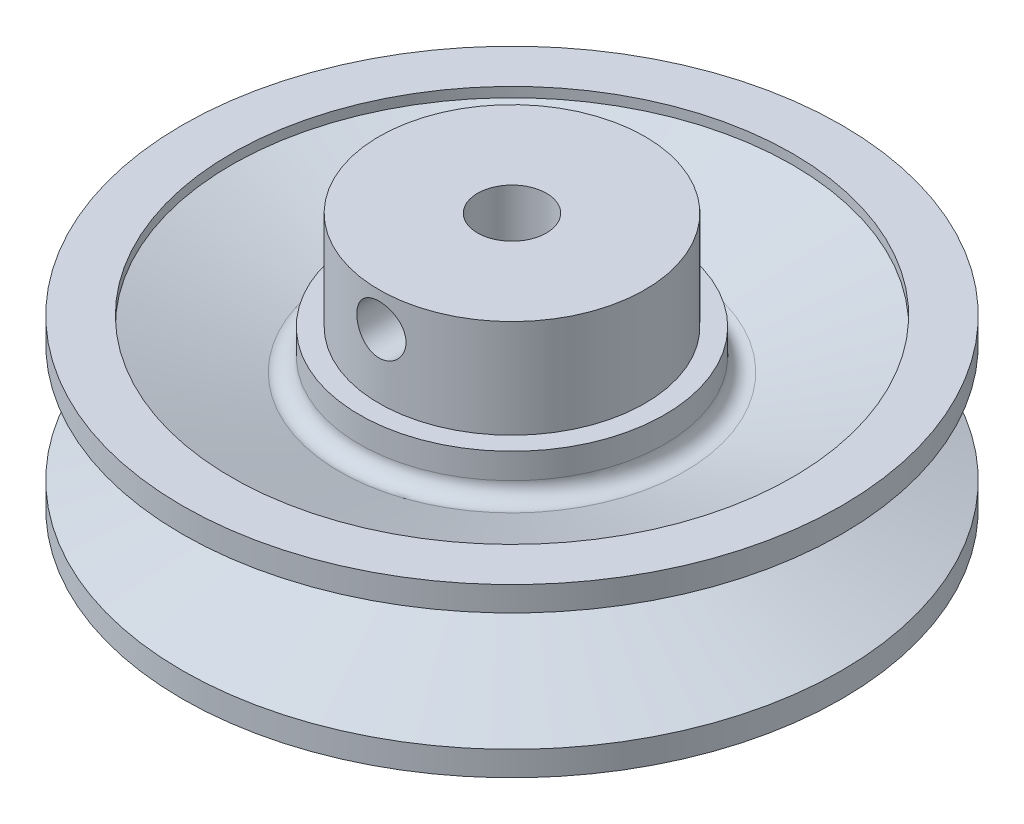
ISO-10303-21;
HEADER;
FILE_DESCRIPTION(('STEP AP214'),'2;1');
FILE_NAME('part.step','',(''),(''),'','','');
FILE_SCHEMA(('AUTOMOTIVE_DESIGN { 1 0 10303 214 1 1 1 1 }'));
ENDSEC;
DATA;
#1=APPLICATION_CONTEXT('core data for automotive mechanical design processes');
#2=APPLICATION_PROTOCOL_DEFINITION('international standard','automotive_design',2000,#1);
#3=PRODUCT_CONTEXT('',#1,'mechanical');
#4=PRODUCT('Part','Part','',(#3));
#5=PRODUCT_RELATED_PRODUCT_CATEGORY('part','',(#4));
#6=PRODUCT_DEFINITION_FORMATION('','',#4);
#7=PRODUCT_DEFINITION_CONTEXT('part definition',#1,'design');
#8=PRODUCT_DEFINITION('design','',#6,#7);
#9=PRODUCT_DEFINITION_SHAPE('','',#8);
#10=(LENGTH_UNIT() NAMED_UNIT(*) SI_UNIT(.MILLI.,.METRE.));
#11=(NAMED_UNIT(*) PLANE_ANGLE_UNIT() SI_UNIT($,.RADIAN.));
#12=(NAMED_UNIT(*) SI_UNIT($,.STERADIAN.) SOLID_ANGLE_UNIT());
#13=UNCERTAINTY_MEASURE_WITH_UNIT(LENGTH_MEASURE(1.E-05),#10,'distance_accuracy_value','');
#14=(GEOMETRIC_REPRESENTATION_CONTEXT(3) GLOBAL_UNCERTAINTY_ASSIGNED_CONTEXT((#13)) GLOBAL_UNIT_ASSIGNED_CONTEXT((#10,
#11,#12)) REPRESENTATION_CONTEXT('',''));
#15=CARTESIAN_POINT('',(0.,0.,0.));
#16=DIRECTION('',(0.,0.,1.));
#17=DIRECTION('',(1.,0.,0.));
#18=AXIS2_PLACEMENT_3D('',#15,#16,#17);
#19=CARTESIAN_POINT('',(0.,0.,0.));
#20=DIRECTION('',(0.,-1.,0.));
#21=DIRECTION('',(0.,0.,-1.));
#22=AXIS2_PLACEMENT_3D('',#19,#20,#21);
#23=CYLINDRICAL_SURFACE('',#22,27.);
#24=CARTESIAN_POINT('',(0.,50.,0.));
#25=DIRECTION('',(0.,-1.,0.));
#26=DIRECTION('',(0.,0.,-1.));
#27=AXIS2_PLACEMENT_3D('',#24,#25,#26);
#28=CIRCLE('',#27,27.);
#29=CARTESIAN_POINT('',(0.,50.,-27.));
#30=VERTEX_POINT('',#29);
#31=EDGE_CURVE('E10',#30,#30,#28,.T.);
#32=ORIENTED_EDGE('',*,*,#31,.T.);
#33=EDGE_LOOP('',(#32));
#34=FACE_BOUND('',#33,.T.);
#35=CARTESIAN_POINT('',(0.,30.,0.));
#36=DIRECTION('',(0.,-1.,0.));
#37=DIRECTION('',(0.,0.,-1.));
#38=AXIS2_PLACEMENT_3D('',#35,#36,#37);
#39=CIRCLE('',#38,27.);
#40=CARTESIAN_POINT('',(0.,30.,-27.));
#41=VERTEX_POINT('',#40);
#42=EDGE_CURVE('E65',#41,#41,#39,.T.);
#43=ORIENTED_EDGE('',*,*,#42,.F.);
#44=EDGE_LOOP('',(#43));
#45=FACE_BOUND('',#44,.T.);
#46=CARTESIAN_POINT('',(-5.,43.,26.5329983228432));
#47=CARTESIAN_POINT('',(-5.,41.6756361697769,26.5329983228432));
#48=CARTESIAN_POINT('',(-4.4554983108542,40.384216943722,26.6460203264625));
#49=CARTESIAN_POINT('',(-2.61474882256838,38.5438946612077,26.889123322101));
#50=CARTESIAN_POINT('',(-1.31038797352559,38.0007640574437,26.9998585079041));
#51=CARTESIAN_POINT('',(1.30455070110879,37.9992376462439,27.0001411765983));
#52=CARTESIAN_POINT('',(2.60426276696771,38.5336328666326,26.8904932750702));
#53=CARTESIAN_POINT('',(4.46514120135219,40.3936358693717,26.644761721359));
#54=CARTESIAN_POINT('',(4.99947677835783,41.6913273924271,26.5330969211231));
#55=CARTESIAN_POINT('',(5.00052242117506,44.3046714400479,26.532899875407));
#56=CARTESIAN_POINT('',(4.45973218645128,45.6096419223939,26.6453330991236));
#57=CARTESIAN_POINT('',(2.61781736776439,47.4549382001344,26.8888456309889));
#58=CARTESIAN_POINT('',(1.32477194849935,47.9990100306413,26.9998166723905));
#59=CARTESIAN_POINT('',(-1.31728862969564,48.0009871693554,27.0001828090904));
#60=CARTESIAN_POINT('',(-2.61260468914529,47.4571139815742,26.8893301325426));
#61=CARTESIAN_POINT('',(-4.45328191960064,45.6191312397522,26.6463892184883));
#62=CARTESIAN_POINT('',(-5.,44.3243638302231,26.5329983228432));
#63=CARTESIAN_POINT('',(-5.,43.,26.5329983228432));
#64=B_SPLINE_CURVE_WITH_KNOTS('',3,(#46,#47,#48,#49,#50,#51,#52,#53,#54,#55,#56,#57,#58,#59,#60,
#61,#62,#63),.UNSPECIFIED.,.T.,.F.,(4,2,2,2,2,2,2,2,4),(0.,0.125,0.25,0.375,0.5,0.625,0.75,
0.875,1.),.UNSPECIFIED.);
#65=CARTESIAN_POINT('',(-5.,43.,26.5329983228432));
#66=VERTEX_POINT('',#65);
#67=EDGE_CURVE('E66',#66,#66,#64,.T.);
#68=ORIENTED_EDGE('',*,*,#67,.F.);
#69=EDGE_LOOP('',(#68));
#70=FACE_BOUND('',#69,.T.);
#71=ADVANCED_FACE('F37',(#34,#45,#70),#23,.T.);
#72=CARTESIAN_POINT('',(0.,0.,0.));
#73=DIRECTION('',(0.,-1.,0.));
#74=DIRECTION('',(0.,0.,-1.));
#75=AXIS2_PLACEMENT_3D('',#72,#73,#74);
#76=CYLINDRICAL_SURFACE('',#75,7.);
#77=CARTESIAN_POINT('',(0.,50.,0.));
#78=DIRECTION('',(0.,-1.,0.));
#79=DIRECTION('',(0.,0.,-1.));
#80=AXIS2_PLACEMENT_3D('',#77,#78,#79);
#81=CIRCLE('',#80,7.00000000000001);
#82=CARTESIAN_POINT('',(0.,50.,-7.00000000000001));
#83=VERTEX_POINT('',#82);
#84=EDGE_CURVE('E47',#83,#83,#81,.T.);
#85=ORIENTED_EDGE('',*,*,#84,.F.);
#86=EDGE_LOOP('',(#85));
#87=FACE_BOUND('',#86,.T.);
#88=CARTESIAN_POINT('',(0.,0.,0.));
#89=DIRECTION('',(0.,-1.,0.));
#90=DIRECTION('',(0.,0.,-1.));
#91=AXIS2_PLACEMENT_3D('',#88,#89,#90);
#92=CIRCLE('',#91,7.);
#93=CARTESIAN_POINT('',(0.,0.,-7.));
#94=VERTEX_POINT('',#93);
#95=EDGE_CURVE('E53',#94,#94,#92,.T.);
#96=ORIENTED_EDGE('',*,*,#95,.T.);
#97=EDGE_LOOP('',(#96));
#98=FACE_BOUND('',#97,.T.);
#99=CARTESIAN_POINT('',(-5.,43.,4.89897948556636));
#100=CARTESIAN_POINT('',(-4.99999437210335,43.1176703517296,4.89898614351292));
#101=CARTESIAN_POINT('',(-4.99567186922445,43.2353542328125,4.9034086755566));
#102=CARTESIAN_POINT('',(-4.97862345239064,43.4694866621261,4.92071636608444));
#103=CARTESIAN_POINT('',(-4.96589534623162,43.5859348800405,4.93360373221554));
#104=CARTESIAN_POINT('',(-4.93242159535366,43.8169019581645,4.96706905828911));
#105=CARTESIAN_POINT('',(-4.91165138637798,43.9314137742843,4.98767057436021));
#106=CARTESIAN_POINT('',(-4.86260241041594,44.1574146700326,5.03550071620006));
#107=CARTESIAN_POINT('',(-4.83432102315968,44.2689026798209,5.06273165436179));
#108=CARTESIAN_POINT('',(-4.76410228555562,44.5113072542028,5.12894888960989));
#109=CARTESIAN_POINT('',(-4.72054571095339,44.6414072233514,5.16920267960502));
#110=CARTESIAN_POINT('',(-4.62395711506582,44.8959346316795,5.25578014691604));
#111=CARTESIAN_POINT('',(-4.57092265072292,45.0203605979019,5.30210538840993));
#112=CARTESIAN_POINT('',(-4.45594483862961,45.2632804146679,5.39909376542027));
#113=CARTESIAN_POINT('',(-4.39399935546881,45.381772834112,5.4497579395248));
#114=CARTESIAN_POINT('',(-4.26160503779288,45.6125853612604,5.55390111495301));
#115=CARTESIAN_POINT('',(-4.19115658865491,45.7249057483622,5.60737998864507));
#116=CARTESIAN_POINT('',(-4.04056919484687,45.9452232302595,5.71687246780774));
#117=CARTESIAN_POINT('',(-3.96027124547675,46.053097245896,5.77291494993612));
#118=CARTESIAN_POINT('',(-3.79124158725112,46.2618472680913,5.88530313017247));
#119=CARTESIAN_POINT('',(-3.70251040390807,46.3627237100233,5.94164880918073));
#120=CARTESIAN_POINT('',(-3.51663605495867,46.556952036024,6.05351373254378));
#121=CARTESIAN_POINT('',(-3.41949148439077,46.650302658302,6.10903283704683));
#122=CARTESIAN_POINT('',(-3.21710922295784,46.8291359536965,6.21799158297414));
#123=CARTESIAN_POINT('',(-3.11187068673141,46.9146178029176,6.27143100630919));
#124=CARTESIAN_POINT('',(-2.88279776135194,47.0855257442818,6.38021296877938));
#125=CARTESIAN_POINT('',(-2.75815599071938,47.1700927158557,6.43521207752071));
#126=CARTESIAN_POINT('',(-2.5001186363087,47.3286453247939,6.53978495317447));
#127=CARTESIAN_POINT('',(-2.36672176330758,47.4026293986624,6.58935791818591));
#128=CARTESIAN_POINT('',(-2.09207461364199,47.5390613011331,6.68163054895019));
#129=CARTESIAN_POINT('',(-1.95083347921182,47.6015222071884,6.72433799909096));
#130=CARTESIAN_POINT('',(-1.66135837806154,47.7139710426707,6.80163959989967));
#131=CARTESIAN_POINT('',(-1.51312754056425,47.7639644917877,6.83623734055258));
#132=CARTESIAN_POINT('',(-1.2526439615662,47.8384790855282,6.88791283700529));
#133=CARTESIAN_POINT('',(-1.14173770958929,47.8662229841621,6.90719111065883));
#134=CARTESIAN_POINT('',(-0.917547114449326,47.9141962470952,6.94052877448783));
#135=CARTESIAN_POINT('',(-0.80426326679295,47.9344271610388,6.95458924089907));
#136=CARTESIAN_POINT('',(-0.576151225095765,47.9669881916842,6.97718939093455));
#137=CARTESIAN_POINT('',(-0.46132496582689,47.9793274065068,6.98573543208824));
#138=CARTESIAN_POINT('',(-0.230799751989467,47.9958370041875,6.99714565068664));
#139=CARTESIAN_POINT('',(-0.115100804606257,48.0000074542302,7.00000987486182));
#140=CARTESIAN_POINT('',(0.116425958472691,47.9999923855351,6.99999006300001));
#141=CARTESIAN_POINT('',(0.232253772962719,47.9957974769211,6.99709956746046));
#142=CARTESIAN_POINT('',(0.463078137446431,47.9792371310877,6.98562239713634));
#143=CARTESIAN_POINT('',(0.578074337641964,47.9668684372918,6.97703345198619));
#144=CARTESIAN_POINT('',(0.80643268401486,47.9342380108079,6.95433906851852));
#145=CARTESIAN_POINT('',(0.919794202517732,47.9139733257767,6.94023156678257));
#146=CARTESIAN_POINT('',(1.1441427732891,47.8659193753937,6.90679570187285));
#147=CARTESIAN_POINT('',(1.25512889183283,47.8381272076875,6.88746532493404));
#148=CARTESIAN_POINT('',(1.58366160836666,47.7440227535665,6.8221522509783));
#149=CARTESIAN_POINT('',(1.79679074061398,47.6669813077342,6.76884676043486));
#150=CARTESIAN_POINT('',(2.20712912585384,47.4876882359366,6.64639180379964));
#151=CARTESIAN_POINT('',(2.40433568169161,47.3854323506939,6.57723966099678));
#152=CARTESIAN_POINT('',(2.70089135578656,47.2065812737203,6.45901476486242));
#153=CARTESIAN_POINT('',(2.80637602109034,47.1374035972995,6.41380624887399));
#154=CARTESIAN_POINT('',(3.01096619195213,46.9919875045051,6.32034191952288));
#155=CARTESIAN_POINT('',(3.11007112753862,46.9157484587414,6.27208583464818));
#156=CARTESIAN_POINT('',(3.30165333788566,46.7564867133952,6.17338681146823));
#157=CARTESIAN_POINT('',(3.39412575141377,46.6734591317099,6.1229423117814));
#158=CARTESIAN_POINT('',(3.52756538409517,46.5440430969829,6.04639684641478));
#159=CARTESIAN_POINT('',(3.57116989993419,46.5000888011508,6.02073345284709));
#160=CARTESIAN_POINT('',(3.65658321552823,46.4105592186614,5.96924506685212));
#161=CARTESIAN_POINT('',(3.69839197467038,46.3649838953854,5.94342007078513));
#162=CARTESIAN_POINT('',(3.83327271415249,46.2121719786356,5.85818820119057));
#163=CARTESIAN_POINT('',(3.92253134123997,46.1015989398087,5.79865154592613));
#164=CARTESIAN_POINT('',(4.09151486393453,45.8728199422744,5.68068046530474));
#165=CARTESIAN_POINT('',(4.17123699746944,45.7546117873866,5.62224636338995));
#166=CARTESIAN_POINT('',(4.32098102153792,45.5108949712408,5.50799321686537));
#167=CARTESIAN_POINT('',(4.39099905720073,45.3853834367274,5.4521752172741));
#168=CARTESIAN_POINT('',(4.52086939851625,45.1275008820734,5.34498184490801));
#169=CARTESIAN_POINT('',(4.58072569916621,44.9951325844456,5.29360473015566));
#170=CARTESIAN_POINT('',(4.71420867563847,44.6626715580468,5.17564806812051));
#171=CARTESIAN_POINT('',(4.78197222711238,44.4588292075875,5.11258400735384));
#172=CARTESIAN_POINT('',(4.86439023991222,44.1444789538605,5.03380114186645));
#173=CARTESIAN_POINT('',(4.88864377826606,44.0383740610643,5.01019135400306));
#174=CARTESIAN_POINT('',(4.93035995471963,43.8236268795388,4.9691455824671));
#175=CARTESIAN_POINT('',(4.94782265445469,43.7149846138489,4.9517095427602));
#176=CARTESIAN_POINT('',(4.97565140600612,43.4945774875166,4.92374805740925));
#177=CARTESIAN_POINT('',(4.98593286332524,43.3827910298193,4.9133050463515));
#178=CARTESIAN_POINT('',(4.99548697400424,43.2144705102254,4.90358290715182));
#179=CARTESIAN_POINT('',(4.99769360412719,43.1582521387095,4.90133265066295));
#180=CARTESIAN_POINT('',(5.00010870204857,43.0457280706927,4.89886882937041));
#181=CARTESIAN_POINT('',(5.0003171694675,42.9894223741753,4.89865526495355));
#182=CARTESIAN_POINT('',(4.99797247463761,42.8205466381661,4.90104970711327));
#183=CARTESIAN_POINT('',(4.99244827556087,42.7080346157976,4.90669380957689));
#184=CARTESIAN_POINT('',(4.9737597813476,42.4843101285887,4.92563536424689));
#185=CARTESIAN_POINT('',(4.96059349201848,42.3730980106869,4.93893481409778));
#186=CARTESIAN_POINT('',(4.92594527215178,42.1458151453528,4.97349945959121));
#187=CARTESIAN_POINT('',(4.90398699717755,42.0298862556206,4.99521816753687));
#188=CARTESIAN_POINT('',(4.85242392000409,41.8012682178354,5.04532195812511));
#189=CARTESIAN_POINT('',(4.82281875998199,41.6885792216621,5.07370735271822));
#190=CARTESIAN_POINT('',(4.72314755740251,41.3555505718866,5.16721931747456));
#191=CARTESIAN_POINT('',(4.64229057082572,41.14065513549,5.24063250544037));
#192=CARTESIAN_POINT('',(4.48696760490026,40.7978790896897,5.3734314496457));
#193=CARTESIAN_POINT('',(4.41960352803829,40.6651677480566,5.42915328690861));
#194=CARTESIAN_POINT('',(4.27427210093846,40.4072632049567,5.54429314269259));
#195=CARTESIAN_POINT('',(4.19630152130789,40.2820723100632,5.6037122839413));
#196=CARTESIAN_POINT('',(4.03013585657614,40.0396394345202,5.72438235142081));
#197=CARTESIAN_POINT('',(3.94194080354899,39.922397428937,5.78563327190491));
#198=CARTESIAN_POINT('',(3.75552541055234,39.6963138766848,5.90834012816556));
#199=CARTESIAN_POINT('',(3.65730687257691,39.5874708262323,5.96979602517708));
#200=CARTESIAN_POINT('',(3.45025665410042,39.3781546932537,6.09181834294568));
#201=CARTESIAN_POINT('',(3.34135919799736,39.277741601362,6.15237621481513));
#202=CARTESIAN_POINT('',(3.11394722565725,39.0864744760406,6.27054691052564));
#203=CARTESIAN_POINT('',(2.99543119944796,38.9956219486384,6.3281592696422));
#204=CARTESIAN_POINT('',(2.74942176057801,38.8241077640453,6.43885543539588));
#205=CARTESIAN_POINT('',(2.62193631831233,38.7434372327061,6.49194317218945));
#206=CARTESIAN_POINT('',(2.35852777972422,38.5929508365282,6.59220668085384));
#207=CARTESIAN_POINT('',(2.22260734766774,38.5231315683949,6.63938430541616));
#208=CARTESIAN_POINT('',(1.9750157430032,38.4098329031727,6.71655326413266));
#209=CARTESIAN_POINT('',(1.86488228076637,38.3639776247513,6.74801049294141));
#210=CARTESIAN_POINT('',(1.6405499876217,38.2797417036841,6.80602745207374));
#211=CARTESIAN_POINT('',(1.52635200996593,38.2413595030561,6.83258820315021));
#212=CARTESIAN_POINT('',(1.2945798456296,38.1725919905603,6.88026501856755));
#213=CARTESIAN_POINT('',(1.17700903633954,38.1421989687933,6.90138633179628));
#214=CARTESIAN_POINT('',(0.939095664022533,38.0898497640886,6.93776468612676));
#215=CARTESIAN_POINT('',(0.818752969790587,38.0678939813943,6.95302144902753));
#216=CARTESIAN_POINT('',(0.575451042581793,38.0327794619467,6.97738398803564));
#217=CARTESIAN_POINT('',(0.452480727192021,38.0196721528138,6.98645380856497));
#218=CARTESIAN_POINT('',(0.205593652682172,38.0028233597311,6.99807114264594));
#219=CARTESIAN_POINT('',(0.0816769725554927,37.9990811024651,7.00061919473085));
#220=CARTESIAN_POINT('',(-0.166021995281207,38.0012920348645,6.99912672857807));
#221=CARTESIAN_POINT('',(-0.28980429135062,38.0072445822414,6.99508664680936));
#222=CARTESIAN_POINT('',(-0.536170635256695,38.0285181911535,6.98052659271687));
#223=CARTESIAN_POINT('',(-0.658754643658864,38.04383955996,6.97000640786356));
#224=CARTESIAN_POINT('',(-0.890945751487311,38.0816262695968,6.94396307665218));
#225=CARTESIAN_POINT('',(-1.00073692451256,38.1033345665666,6.928968433556));
#226=CARTESIAN_POINT('',(-1.21792508497925,38.1537573784524,6.89411150176085));
#227=CARTESIAN_POINT('',(-1.32532130434645,38.1824741067218,6.87424767530195));
#228=CARTESIAN_POINT('',(-1.64309315359617,38.278548107869,6.80786214042564));
#229=CARTESIAN_POINT('',(-1.84913026125822,38.3558423498312,6.75453722921048));
#230=CARTESIAN_POINT('',(-2.26792988339106,38.5436425751574,6.62643219492215));
#231=CARTESIAN_POINT('',(-2.47893822136013,38.6568669768515,6.54993699772331));
#232=CARTESIAN_POINT('',(-2.77914683196633,38.8457834358403,6.42558437014152));
#233=CARTESIAN_POINT('',(-2.87653154075774,38.9119631417593,6.3825144204296));
#234=CARTESIAN_POINT('',(-3.06566001595455,39.0504518357325,6.29385570288298));
#235=CARTESIAN_POINT('',(-3.15740376099067,39.1227608470037,6.24826692550764));
#236=CARTESIAN_POINT('',(-3.34983723239907,39.2859549440728,6.14754275208751));
#237=CARTESIAN_POINT('',(-3.44944496056085,39.3779211227758,6.0920890482518));
#238=CARTESIAN_POINT('',(-3.64020021474638,39.5696394664461,5.98006615672284));
#239=CARTESIAN_POINT('',(-3.73134625893237,39.6693929895489,5.92349677574374));
#240=CARTESIAN_POINT('',(-3.90525611625939,39.8761664629605,5.81031352437588));
#241=CARTESIAN_POINT('',(-3.98800969249569,39.9831950277121,5.75369968255993));
#242=CARTESIAN_POINT('',(-4.14484639364846,40.2040483906997,5.64176660372771));
#243=CARTESIAN_POINT('',(-4.21893034240861,40.3178725416206,5.58644724410176));
#244=CARTESIAN_POINT('',(-4.35186779385189,40.5414198273271,5.48339846872648));
#245=CARTESIAN_POINT('',(-4.41149372929287,40.6505740388515,5.43543639881268));
#246=CARTESIAN_POINT('',(-4.52308152334717,40.8740669282036,5.34293848126412));
#247=CARTESIAN_POINT('',(-4.57504302720813,40.9884058456881,5.29840279226689));
#248=CARTESIAN_POINT('',(-4.7186798501766,41.3387475712064,5.17206668251317));
#249=CARTESIAN_POINT('',(-4.7984611872623,41.5826640064169,5.09725191375473));
#250=CARTESIAN_POINT('',(-4.88237234980791,41.9283965089007,5.01631781655848));
#251=CARTESIAN_POINT('',(-4.90256824284913,42.023398257073,4.99654146679653));
#252=CARTESIAN_POINT('',(-4.93749780706711,42.2152833988071,4.96202771431199));
#253=CARTESIAN_POINT('',(-4.95223465678681,42.3121656627382,4.94728737974552));
#254=CARTESIAN_POINT('',(-4.97594971635271,42.5071832085463,4.92343473395194));
#255=CARTESIAN_POINT('',(-4.98493601071948,42.6053165326217,4.91431452224654));
#256=CARTESIAN_POINT('',(-4.99696265268473,42.8022968653534,4.90208497466529));
#257=CARTESIAN_POINT('',(-5.00000472806672,42.9011436582414,4.89897389214176));
#258=CARTESIAN_POINT('',(-5.,43.,4.89897948556636));
#259=B_SPLINE_CURVE_WITH_KNOTS('',3,(#99,#100,#101,#102,#103,#104,#105,#106,#107,#108,#109,#110,
#111,#112,#113,#114,#115,#116,#117,#118,#119,#120,#121,#122,#123,#124,#125,#126,#127,#128,#129,
#130,#131,#132,#133,#134,#135,#136,#137,#138,#139,#140,#141,#142,#143,#144,#145,#146,#147,#148,
#149,#150,#151,#152,#153,#154,#155,#156,#157,#158,#159,#160,#161,#162,#163,#164,#165,#166,#167,
#168,#169,#170,#171,#172,#173,#174,#175,#176,#177,#178,#179,#180,#181,#182,#183,#184,#185,#186,
#187,#188,#189,#190,#191,#192,#193,#194,#195,#196,#197,#198,#199,#200,#201,#202,#203,#204,#205,
#206,#207,#208,#209,#210,#211,#212,#213,#214,#215,#216,#217,#218,#219,#220,#221,#222,#223,#224,
#225,#226,#227,#228,#229,#230,#231,#232,#233,#234,#235,#236,#237,#238,#239,#240,#241,#242,#243,
#244,#245,#246,#247,#248,#249,#250,#251,#252,#253,#254,#255,#256,#257,#258),.UNSPECIFIED.,.T.,
.F.,(4,2,2,2,2,2,2,2,2,2,2,2,2,2,2,2,2,2,2,2,2,2,2,2,2,2,2,2,2,2,2,2,2,2,2,2,2,2,2,2,2,2,2,2,2,
2,2,2,2,2,2,2,2,2,2,2,2,2,2,2,2,2,2,2,2,2,2,2,2,2,2,2,2,2,2,2,2,2,2,4),(0.,0.352881991162773,
0.705856051269835,1.05991687053726,1.41410136630897,1.84240488997178,2.27081897446541,
2.69933589440609,3.1278334001008,3.56449174549984,4.00112289858582,4.43782710633752,
4.8745769870679,5.35496941300746,5.83543273801369,6.31534739298962,6.79504919768119,
7.14251239696189,7.48990388787316,7.83689415538949,8.18388156904955,8.53125868540285,
8.87877428627311,9.22641994951478,9.57419984498497,10.2697350047951,10.9653877364904,
11.3670602782704,11.7687686562202,12.17076851516,12.3717959527595,12.572827934407,
13.0344952916057,13.4962960402689,13.958279712772,14.4200813377116,15.0889883594022,
15.4227793878832,15.7565673867229,16.0942239269118,16.263080429138,16.4319369634344,
16.7696999534225,17.107551121834,17.4669266065352,17.8263189106436,18.5463385027923,
19.0226242704954,19.4990553802523,19.9754849954918,20.4518291099293,20.9313174667583,
21.4108812422605,21.8900241232641,22.3690164255404,22.7387876448812,23.1084816918262,
23.4778176474136,23.8471711213012,24.2186532219295,24.5901046465329,24.9615314631906,
25.3329704622726,25.671356290231,26.0098491234209,26.6865976322086,27.4378046429164,
27.8136819844495,28.1895607498051,28.6285105940969,29.0675371642839,29.507092964108,
29.9466069605406,30.3461374085566,30.7456863432566,31.542573333317,31.8397118383128,
32.1366770606427,32.4332238665691,32.729684463534),.UNSPECIFIED.);
#260=CARTESIAN_POINT('',(-5.,43.,4.89897948556636));
#261=VERTEX_POINT('',#260);
#262=EDGE_CURVE('E57',#261,#261,#259,.T.);
#263=ORIENTED_EDGE('',*,*,#262,.F.);
#264=EDGE_LOOP('',(#263));
#265=FACE_BOUND('',#264,.T.);
#266=ADVANCED_FACE('F68',(#87,#98,#265),#76,.F.);
#267=CARTESIAN_POINT('',(-7.00000000000001,50.,0.));
#268=DIRECTION('',(0.,-1.,0.));
#269=DIRECTION('',(0.,0.,-1.));
#270=AXIS2_PLACEMENT_3D('',#267,#268,#269);
#271=PLANE('',#270);
#272=ORIENTED_EDGE('',*,*,#31,.F.);
#273=EDGE_LOOP('',(#272));
#274=FACE_BOUND('',#273,.T.);
#275=ORIENTED_EDGE('',*,*,#84,.T.);
#276=EDGE_LOOP('',(#275));
#277=FACE_BOUND('',#276,.T.);
#278=ADVANCED_FACE('F181',(#274,#277),#271,.F.);
#279=CARTESIAN_POINT('',(-31.,0.,0.));
#280=DIRECTION('',(0.,1.,0.));
#281=DIRECTION('',(0.,0.,1.));
#282=AXIS2_PLACEMENT_3D('',#279,#280,#281);
#283=PLANE('',#282);
#284=ORIENTED_EDGE('',*,*,#95,.F.);
#285=EDGE_LOOP('',(#284));
#286=FACE_BOUND('',#285,.T.);
#287=CARTESIAN_POINT('',(0.,0.,0.));
#288=DIRECTION('',(0.,-1.,0.));
#289=DIRECTION('',(0.,0.,-1.));
#290=AXIS2_PLACEMENT_3D('',#287,#288,#289);
#291=CIRCLE('',#290,31.);
#292=CARTESIAN_POINT('',(0.,0.,-31.));
#293=VERTEX_POINT('',#292);
#294=EDGE_CURVE('E168',#293,#293,#291,.T.);
#295=ORIENTED_EDGE('',*,*,#294,.T.);
#296=EDGE_LOOP('',(#295));
#297=FACE_BOUND('',#296,.T.);
#298=ADVANCED_FACE('F177',(#286,#297),#283,.F.);
#299=CARTESIAN_POINT('',(0.,0.,0.));
#300=DIRECTION('',(0.,-1.,0.));
#301=DIRECTION('',(0.,0.,-1.));
#302=AXIS2_PLACEMENT_3D('',#299,#300,#301);
#303=CYLINDRICAL_SURFACE('',#302,31.);
#304=ORIENTED_EDGE('',*,*,#294,.F.);
#305=EDGE_LOOP('',(#304));
#306=FACE_BOUND('',#305,.T.);
#307=CARTESIAN_POINT('',(0.,5.17878207069485,0.));
#308=DIRECTION('',(0.,-1.,0.));
#309=DIRECTION('',(0.,0.,-1.));
#310=AXIS2_PLACEMENT_3D('',#307,#308,#309);
#311=CIRCLE('',#310,31.);
#312=CARTESIAN_POINT('',(0.,5.17878207069485,-31.));
#313=VERTEX_POINT('',#312);
#314=EDGE_CURVE('E164',#313,#313,#311,.T.);
#315=ORIENTED_EDGE('',*,*,#314,.T.);
#316=EDGE_LOOP('',(#315));
#317=FACE_BOUND('',#316,.T.);
#318=ADVANCED_FACE('F180',(#306,#317),#303,.T.);
#319=CARTESIAN_POINT('',(0.,5.17878207069485,0.));
#320=DIRECTION('',(0.,-1.,0.));
#321=DIRECTION('',(0.,0.,-1.));
#322=AXIS2_PLACEMENT_3D('',#319,#320,#321);
#323=TOROIDAL_SURFACE('',#322,34.,3.);
#324=ORIENTED_EDGE('',*,*,#314,.F.);
#325=EDGE_LOOP('',(#324));
#326=FACE_BOUND('',#325,.T.);
#327=CARTESIAN_POINT('',(0.,7.99785993305257,0.));
#328=DIRECTION('',(0.,-1.,0.));
#329=DIRECTION('',(0.,0.,-1.));
#330=AXIS2_PLACEMENT_3D('',#327,#328,#329);
#331=CIRCLE('',#330,35.026060429977);
#332=CARTESIAN_POINT('',(0.,7.99785993305257,-35.026060429977));
#333=VERTEX_POINT('',#332);
#334=EDGE_CURVE('E160',#333,#333,#331,.T.);
#335=ORIENTED_EDGE('',*,*,#334,.T.);
#336=EDGE_LOOP('',(#335));
#337=FACE_BOUND('',#336,.T.);
#338=ADVANCED_FACE('F186',(#326,#337),#323,.F.);
#339=CARTESIAN_POINT('',(0.,0.,0.));
#340=DIRECTION('',(0.,-1.,0.));
#341=DIRECTION('',(0.,0.,-1.));
#342=AXIS2_PLACEMENT_3D('',#339,#340,#341);
#343=CONICAL_SURFACE('',#342,57.,1.22173047639603);
#344=ORIENTED_EDGE('',*,*,#334,.F.);
#345=EDGE_LOOP('',(#344));
#346=FACE_BOUND('',#345,.T.);
#347=CARTESIAN_POINT('',(0.,0.,0.));
#348=DIRECTION('',(0.,-1.,0.));
#349=DIRECTION('',(0.,0.,-1.));
#350=AXIS2_PLACEMENT_3D('',#347,#348,#349);
#351=CIRCLE('',#350,57.);
#352=CARTESIAN_POINT('',(0.,0.,-57.));
#353=VERTEX_POINT('',#352);
#354=EDGE_CURVE('E156',#353,#353,#351,.T.);
#355=ORIENTED_EDGE('',*,*,#354,.T.);
#356=EDGE_LOOP('',(#355));
#357=FACE_BOUND('',#356,.T.);
#358=ADVANCED_FACE('F192',(#346,#357),#343,.F.);
#359=CARTESIAN_POINT('',(0.,0.,0.));
#360=DIRECTION('',(0.,-1.,0.));
#361=DIRECTION('',(0.,0.,-1.));
#362=AXIS2_PLACEMENT_3D('',#359,#360,#361);
#363=CYLINDRICAL_SURFACE('',#362,57.);
#364=ORIENTED_EDGE('',*,*,#354,.F.);
#365=EDGE_LOOP('',(#364));
#366=FACE_BOUND('',#365,.T.);
#367=CARTESIAN_POINT('',(0.,-2.,0.));
#368=DIRECTION('',(0.,-1.,0.));
#369=DIRECTION('',(0.,0.,-1.));
#370=AXIS2_PLACEMENT_3D('',#367,#368,#369);
#371=CIRCLE('',#370,57.);
#372=CARTESIAN_POINT('',(0.,-2.,-57.));
#373=VERTEX_POINT('',#372);
#374=EDGE_CURVE('E152',#373,#373,#371,.T.);
#375=ORIENTED_EDGE('',*,*,#374,.T.);
#376=EDGE_LOOP('',(#375));
#377=FACE_BOUND('',#376,.T.);
#378=ADVANCED_FACE('F198',(#366,#377),#363,.F.);
#379=CARTESIAN_POINT('',(-67.,-2.,0.));
#380=DIRECTION('',(0.,1.,0.));
#381=DIRECTION('',(0.,0.,1.));
#382=AXIS2_PLACEMENT_3D('',#379,#380,#381);
#383=PLANE('',#382);
#384=ORIENTED_EDGE('',*,*,#374,.F.);
#385=EDGE_LOOP('',(#384));
#386=FACE_BOUND('',#385,.T.);
#387=CARTESIAN_POINT('',(0.,-2.,0.));
#388=DIRECTION('',(0.,-1.,0.));
#389=DIRECTION('',(0.,0.,-1.));
#390=AXIS2_PLACEMENT_3D('',#387,#388,#389);
#391=CIRCLE('',#390,67.);
#392=CARTESIAN_POINT('',(0.,-2.,-67.));
#393=VERTEX_POINT('',#392);
#394=EDGE_CURVE('E148',#393,#393,#391,.T.);
#395=ORIENTED_EDGE('',*,*,#394,.T.);
#396=EDGE_LOOP('',(#395));
#397=FACE_BOUND('',#396,.T.);
#398=ADVANCED_FACE('F204',(#386,#397),#383,.F.);
#399=CARTESIAN_POINT('',(0.,0.,0.));
#400=DIRECTION('',(0.,-1.,0.));
#401=DIRECTION('',(0.,0.,-1.));
#402=AXIS2_PLACEMENT_3D('',#399,#400,#401);
#403=CYLINDRICAL_SURFACE('',#402,67.);
#404=ORIENTED_EDGE('',*,*,#394,.F.);
#405=EDGE_LOOP('',(#404));
#406=FACE_BOUND('',#405,.T.);
#407=CARTESIAN_POINT('',(0.,3.,0.));
#408=DIRECTION('',(0.,-1.,0.));
#409=DIRECTION('',(0.,0.,-1.));
#410=AXIS2_PLACEMENT_3D('',#407,#408,#409);
#411=CIRCLE('',#410,67.);
#412=CARTESIAN_POINT('',(0.,3.,-67.));
#413=VERTEX_POINT('',#412);
#414=EDGE_CURVE('E144',#413,#413,#411,.T.);
#415=ORIENTED_EDGE('',*,*,#414,.T.);
#416=EDGE_LOOP('',(#415));
#417=FACE_BOUND('',#416,.T.);
#418=ADVANCED_FACE('F210',(#406,#417),#403,.T.);
#419=CARTESIAN_POINT('',(0.,11.3808006089264,0.));
#420=DIRECTION('',(0.,-1.,0.));
#421=DIRECTION('',(0.,0.,-1.));
#422=AXIS2_PLACEMENT_3D('',#419,#420,#421);
#423=CONICAL_SURFACE('',#422,43.973939570023,1.22173047639603);
#424=ORIENTED_EDGE('',*,*,#414,.F.);
#425=EDGE_LOOP('',(#424));
#426=FACE_BOUND('',#425,.T.);
#427=CARTESIAN_POINT('',(0.,11.3808006089264,0.));
#428=DIRECTION('',(0.,-1.,0.));
#429=DIRECTION('',(0.,0.,-1.));
#430=AXIS2_PLACEMENT_3D('',#427,#428,#429);
#431=CIRCLE('',#430,43.973939570023);
#432=CARTESIAN_POINT('',(0.,11.3808006089264,-43.973939570023));
#433=VERTEX_POINT('',#432);
#434=EDGE_CURVE('E140',#433,#433,#431,.T.);
#435=ORIENTED_EDGE('',*,*,#434,.T.);
#436=EDGE_LOOP('',(#435));
#437=FACE_BOUND('',#436,.T.);
#438=ADVANCED_FACE('F216',(#426,#437),#423,.T.);
#439=CARTESIAN_POINT('',(0.,14.1998784712841,0.));
#440=DIRECTION('',(0.,-1.,0.));
#441=DIRECTION('',(0.,0.,-1.));
#442=AXIS2_PLACEMENT_3D('',#439,#440,#441);
#443=TOROIDAL_SURFACE('',#442,45.,3.);
#444=ORIENTED_EDGE('',*,*,#434,.F.);
#445=EDGE_LOOP('',(#444));
#446=FACE_BOUND('',#445,.T.);
#447=CARTESIAN_POINT('',(0.,14.1998784712841,0.));
#448=DIRECTION('',(0.,-1.,0.));
#449=DIRECTION('',(0.,0.,-1.));
#450=AXIS2_PLACEMENT_3D('',#447,#448,#449);
#451=CIRCLE('',#450,42.);
#452=CARTESIAN_POINT('',(0.,14.1998784712841,-42.));
#453=VERTEX_POINT('',#452);
#454=EDGE_CURVE('E136',#453,#453,#451,.T.);
#455=ORIENTED_EDGE('',*,*,#454,.T.);
#456=EDGE_LOOP('',(#455));
#457=FACE_BOUND('',#456,.T.);
#458=ADVANCED_FACE('F222',(#446,#457),#443,.F.);
#459=CARTESIAN_POINT('',(0.,0.,0.));
#460=DIRECTION('',(0.,-1.,0.));
#461=DIRECTION('',(0.,0.,-1.));
#462=AXIS2_PLACEMENT_3D('',#459,#460,#461);
#463=CYLINDRICAL_SURFACE('',#462,42.);
#464=ORIENTED_EDGE('',*,*,#454,.F.);
#465=EDGE_LOOP('',(#464));
#466=FACE_BOUND('',#465,.T.);
#467=CARTESIAN_POINT('',(0.,15.8001215287159,0.));
#468=DIRECTION('',(0.,-1.,0.));
#469=DIRECTION('',(0.,0.,-1.));
#470=AXIS2_PLACEMENT_3D('',#467,#468,#469);
#471=CIRCLE('',#470,42.);
#472=CARTESIAN_POINT('',(0.,15.8001215287159,-42.));
#473=VERTEX_POINT('',#472);
#474=EDGE_CURVE('E132',#473,#473,#471,.T.);
#475=ORIENTED_EDGE('',*,*,#474,.T.);
#476=EDGE_LOOP('',(#475));
#477=FACE_BOUND('',#476,.T.);
#478=ADVANCED_FACE('F228',(#466,#477),#463,.T.);
#479=CARTESIAN_POINT('',(0.,15.8001215287159,0.));
#480=DIRECTION('',(0.,-1.,0.));
#481=DIRECTION('',(0.,0.,-1.));
#482=AXIS2_PLACEMENT_3D('',#479,#480,#481);
#483=TOROIDAL_SURFACE('',#482,45.,3.);
#484=ORIENTED_EDGE('',*,*,#474,.F.);
#485=EDGE_LOOP('',(#484));
#486=FACE_BOUND('',#485,.T.);
#487=CARTESIAN_POINT('',(0.,18.6191993910736,0.));
#488=DIRECTION('',(0.,-1.,0.));
#489=DIRECTION('',(0.,0.,-1.));
#490=AXIS2_PLACEMENT_3D('',#487,#488,#489);
#491=CIRCLE('',#490,43.973939570023);
#492=CARTESIAN_POINT('',(0.,18.6191993910736,-43.973939570023));
#493=VERTEX_POINT('',#492);
#494=EDGE_CURVE('E128',#493,#493,#491,.T.);
#495=ORIENTED_EDGE('',*,*,#494,.T.);
#496=EDGE_LOOP('',(#495));
#497=FACE_BOUND('',#496,.T.);
#498=ADVANCED_FACE('F234',(#486,#497),#483,.F.);
#499=CARTESIAN_POINT('',(0.,27.,0.));
#500=DIRECTION('',(0.,1.,0.));
#501=DIRECTION('',(0.,0.,1.));
#502=AXIS2_PLACEMENT_3D('',#499,#500,#501);
#503=CONICAL_SURFACE('',#502,67.,1.22173047639603);
#504=ORIENTED_EDGE('',*,*,#494,.F.);
#505=EDGE_LOOP('',(#504));
#506=FACE_BOUND('',#505,.T.);
#507=CARTESIAN_POINT('',(0.,27.,0.));
#508=DIRECTION('',(0.,-1.,0.));
#509=DIRECTION('',(0.,0.,-1.));
#510=AXIS2_PLACEMENT_3D('',#507,#508,#509);
#511=CIRCLE('',#510,67.);
#512=CARTESIAN_POINT('',(0.,27.,-67.));
#513=VERTEX_POINT('',#512);
#514=EDGE_CURVE('E124',#513,#513,#511,.T.);
#515=ORIENTED_EDGE('',*,*,#514,.T.);
#516=EDGE_LOOP('',(#515));
#517=FACE_BOUND('',#516,.T.);
#518=ADVANCED_FACE('F240',(#506,#517),#503,.T.);
#519=CARTESIAN_POINT('',(0.,0.,0.));
#520=DIRECTION('',(0.,-1.,0.));
#521=DIRECTION('',(0.,0.,-1.));
#522=AXIS2_PLACEMENT_3D('',#519,#520,#521);
#523=CYLINDRICAL_SURFACE('',#522,67.);
#524=ORIENTED_EDGE('',*,*,#514,.F.);
#525=EDGE_LOOP('',(#524));
#526=FACE_BOUND('',#525,.T.);
#527=CARTESIAN_POINT('',(0.,32.,0.));
#528=DIRECTION('',(0.,-1.,0.));
#529=DIRECTION('',(0.,0.,-1.));
#530=AXIS2_PLACEMENT_3D('',#527,#528,#529);
#531=CIRCLE('',#530,67.);
#532=CARTESIAN_POINT('',(0.,32.,-67.));
#533=VERTEX_POINT('',#532);
#534=EDGE_CURVE('E120',#533,#533,#531,.T.);
#535=ORIENTED_EDGE('',*,*,#534,.T.);
#536=EDGE_LOOP('',(#535));
#537=FACE_BOUND('',#536,.T.);
#538=ADVANCED_FACE('F246',(#526,#537),#523,.T.);
#539=CARTESIAN_POINT('',(-57.,32.,0.));
#540=DIRECTION('',(0.,-1.,0.));
#541=DIRECTION('',(0.,0.,-1.));
#542=AXIS2_PLACEMENT_3D('',#539,#540,#541);
#543=PLANE('',#542);
#544=ORIENTED_EDGE('',*,*,#534,.F.);
#545=EDGE_LOOP('',(#544));
#546=FACE_BOUND('',#545,.T.);
#547=CARTESIAN_POINT('',(0.,32.,0.));
#548=DIRECTION('',(0.,-1.,0.));
#549=DIRECTION('',(0.,0.,-1.));
#550=AXIS2_PLACEMENT_3D('',#547,#548,#549);
#551=CIRCLE('',#550,57.);
#552=CARTESIAN_POINT('',(0.,32.,-57.));
#553=VERTEX_POINT('',#552);
#554=EDGE_CURVE('E116',#553,#553,#551,.T.);
#555=ORIENTED_EDGE('',*,*,#554,.T.);
#556=EDGE_LOOP('',(#555));
#557=FACE_BOUND('',#556,.T.);
#558=ADVANCED_FACE('F252',(#546,#557),#543,.F.);
#559=CARTESIAN_POINT('',(0.,0.,0.));
#560=DIRECTION('',(0.,-1.,0.));
#561=DIRECTION('',(0.,0.,-1.));
#562=AXIS2_PLACEMENT_3D('',#559,#560,#561);
#563=CYLINDRICAL_SURFACE('',#562,57.);
#564=ORIENTED_EDGE('',*,*,#554,.F.);
#565=EDGE_LOOP('',(#564));
#566=FACE_BOUND('',#565,.T.);
#567=CARTESIAN_POINT('',(0.,30.,0.));
#568=DIRECTION('',(0.,-1.,0.));
#569=DIRECTION('',(0.,0.,-1.));
#570=AXIS2_PLACEMENT_3D('',#567,#568,#569);
#571=CIRCLE('',#570,57.);
#572=CARTESIAN_POINT('',(0.,30.,-57.));
#573=VERTEX_POINT('',#572);
#574=EDGE_CURVE('E112',#573,#573,#571,.T.);
#575=ORIENTED_EDGE('',*,*,#574,.T.);
#576=EDGE_LOOP('',(#575));
#577=FACE_BOUND('',#576,.T.);
#578=ADVANCED_FACE('F258',(#566,#577),#563,.F.);
#579=CARTESIAN_POINT('',(0.,22.0021400669474,0.));
#580=DIRECTION('',(0.,1.,0.));
#581=DIRECTION('',(0.,0.,1.));
#582=AXIS2_PLACEMENT_3D('',#579,#580,#581);
#583=CONICAL_SURFACE('',#582,35.026060429977,1.22173047639603);
#584=ORIENTED_EDGE('',*,*,#574,.F.);
#585=EDGE_LOOP('',(#584));
#586=FACE_BOUND('',#585,.T.);
#587=CARTESIAN_POINT('',(0.,22.0021400669474,0.));
#588=DIRECTION('',(0.,-1.,0.));
#589=DIRECTION('',(0.,0.,-1.));
#590=AXIS2_PLACEMENT_3D('',#587,#588,#589);
#591=CIRCLE('',#590,35.026060429977);
#592=CARTESIAN_POINT('',(0.,22.0021400669474,-35.026060429977));
#593=VERTEX_POINT('',#592);
#594=EDGE_CURVE('E108',#593,#593,#591,.T.);
#595=ORIENTED_EDGE('',*,*,#594,.T.);
#596=EDGE_LOOP('',(#595));
#597=FACE_BOUND('',#596,.T.);
#598=ADVANCED_FACE('F264',(#586,#597),#583,.F.);
#599=CARTESIAN_POINT('',(0.,24.8212179293052,0.));
#600=DIRECTION('',(0.,-1.,0.));
#601=DIRECTION('',(0.,0.,-1.));
#602=AXIS2_PLACEMENT_3D('',#599,#600,#601);
#603=TOROIDAL_SURFACE('',#602,34.,3.);
#604=ORIENTED_EDGE('',*,*,#594,.F.);
#605=EDGE_LOOP('',(#604));
#606=FACE_BOUND('',#605,.T.);
#607=CARTESIAN_POINT('',(0.,24.8212179293052,0.));
#608=DIRECTION('',(0.,-1.,0.));
#609=DIRECTION('',(0.,0.,-1.));
#610=AXIS2_PLACEMENT_3D('',#607,#608,#609);
#611=CIRCLE('',#610,31.);
#612=CARTESIAN_POINT('',(0.,24.8212179293052,-31.));
#613=VERTEX_POINT('',#612);
#614=EDGE_CURVE('E104',#613,#613,#611,.T.);
#615=ORIENTED_EDGE('',*,*,#614,.T.);
#616=EDGE_LOOP('',(#615));
#617=FACE_BOUND('',#616,.T.);
#618=ADVANCED_FACE('F270',(#606,#617),#603,.F.);
#619=CARTESIAN_POINT('',(0.,0.,0.));
#620=DIRECTION('',(0.,-1.,0.));
#621=DIRECTION('',(0.,0.,-1.));
#622=AXIS2_PLACEMENT_3D('',#619,#620,#621);
#623=CYLINDRICAL_SURFACE('',#622,31.);
#624=ORIENTED_EDGE('',*,*,#614,.F.);
#625=EDGE_LOOP('',(#624));
#626=FACE_BOUND('',#625,.T.);
#627=CARTESIAN_POINT('',(0.,30.,0.));
#628=DIRECTION('',(0.,-1.,0.));
#629=DIRECTION('',(0.,0.,-1.));
#630=AXIS2_PLACEMENT_3D('',#627,#628,#629);
#631=CIRCLE('',#630,31.);
#632=CARTESIAN_POINT('',(0.,30.,-31.));
#633=VERTEX_POINT('',#632);
#634=EDGE_CURVE('E100',#633,#633,#631,.T.);
#635=ORIENTED_EDGE('',*,*,#634,.T.);
#636=EDGE_LOOP('',(#635));
#637=FACE_BOUND('',#636,.T.);
#638=ADVANCED_FACE('F276',(#626,#637),#623,.T.);
#639=CARTESIAN_POINT('',(-27.,30.,0.));
#640=DIRECTION('',(0.,-1.,0.));
#641=DIRECTION('',(0.,0.,-1.));
#642=AXIS2_PLACEMENT_3D('',#639,#640,#641);
#643=PLANE('',#642);
#644=ORIENTED_EDGE('',*,*,#634,.F.);
#645=EDGE_LOOP('',(#644));
#646=FACE_BOUND('',#645,.T.);
#647=ORIENTED_EDGE('',*,*,#42,.T.);
#648=EDGE_LOOP('',(#647));
#649=FACE_BOUND('',#648,.T.);
#650=ADVANCED_FACE('F76',(#646,#649),#643,.F.);
#651=CARTESIAN_POINT('',(-5.,43.,26.5329983228432));
#652=CARTESIAN_POINT('',(-5.,41.6756361697769,26.5329983228432));
#653=CARTESIAN_POINT('',(-4.4554983108542,40.384216943722,26.6460203264625));
#654=CARTESIAN_POINT('',(-2.61474882256838,38.5438946612077,26.889123322101));
#655=CARTESIAN_POINT('',(-1.31038797352559,38.0007640574437,26.9998585079041));
#656=CARTESIAN_POINT('',(1.30455070110879,37.9992376462439,27.0001411765983));
#657=CARTESIAN_POINT('',(2.60426276696771,38.5336328666326,26.8904932750702));
#658=CARTESIAN_POINT('',(4.46514120135219,40.3936358693717,26.644761721359));
#659=CARTESIAN_POINT('',(4.99947677835783,41.6913273924271,26.5330969211231));
#660=CARTESIAN_POINT('',(5.00052242117506,44.3046714400479,26.532899875407));
#661=CARTESIAN_POINT('',(4.45973218645128,45.6096419223939,26.6453330991236));
#662=CARTESIAN_POINT('',(2.61781736776439,47.4549382001344,26.8888456309889));
#663=CARTESIAN_POINT('',(1.32477194849935,47.9990100306413,26.9998166723905));
#664=CARTESIAN_POINT('',(-1.31728862969564,48.0009871693554,27.0001828090904));
#665=CARTESIAN_POINT('',(-2.61260468914529,47.4571139815742,26.8893301325426));
#666=CARTESIAN_POINT('',(-4.45328191960064,45.6191312397522,26.6463892184883));
#667=CARTESIAN_POINT('',(-5.,44.3243638302231,26.5329983228432));
#668=CARTESIAN_POINT('',(-5.,43.,26.5329983228432));
#669=B_SPLINE_CURVE_WITH_KNOTS('',3,(#651,#652,#653,#654,#655,#656,#657,#658,#659,#660,#661,
#662,#663,#664,#665,#666,#667,#668),.UNSPECIFIED.,.T.,.F.,(4,2,2,2,2,2,2,2,4),(0.,0.125,0.25,
0.375,0.5,0.625,0.75,0.875,1.),.UNSPECIFIED.);
#670=DIRECTION('',(0.,0.,-1.));
#671=VECTOR('',#670,1.);
#672=SURFACE_OF_LINEAR_EXTRUSION('',#669,#671);
#673=ORIENTED_EDGE('',*,*,#67,.T.);
#674=EDGE_LOOP('',(#673));
#675=FACE_BOUND('',#674,.T.);
#676=ORIENTED_EDGE('',*,*,#262,.T.);
#677=EDGE_LOOP('',(#676));
#678=FACE_BOUND('',#677,.T.);
#679=ADVANCED_FACE('F71',(#675,#678),#672,.T.);
#680=CLOSED_SHELL('',(#71,#266,#278,#298,#318,#338,#358,#378,#398,#418,#438,#458,#478,#498,#518,
#538,#558,#578,#598,#618,#638,#650,#679));
#681=MANIFOLD_SOLID_BREP('B2',#680);
#682=ADVANCED_BREP_SHAPE_REPRESENTATION('',(#18,#681),#14);
#683=SHAPE_DEFINITION_REPRESENTATION(#9,#682);
ENDSEC;
END-ISO-10303-21;
